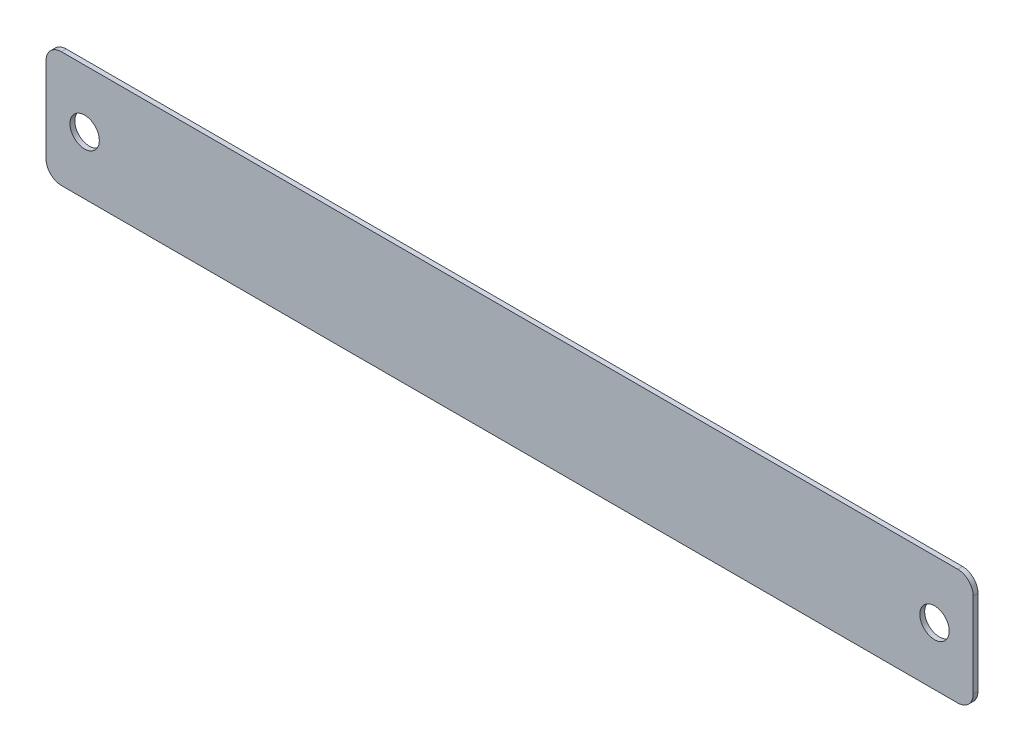
ISO-10303-21;
HEADER;
FILE_DESCRIPTION(('STEP AP214'),'2;1');
FILE_NAME('part.step','',(''),(''),'','','');
FILE_SCHEMA(('AUTOMOTIVE_DESIGN { 1 0 10303 214 1 1 1 1 }'));
ENDSEC;
DATA;
#1=APPLICATION_CONTEXT('core data for automotive mechanical design processes');
#2=APPLICATION_PROTOCOL_DEFINITION('international standard','automotive_design',2000,#1);
#3=PRODUCT_CONTEXT('',#1,'mechanical');
#4=PRODUCT('Part','Part','',(#3));
#5=PRODUCT_RELATED_PRODUCT_CATEGORY('part','',(#4));
#6=PRODUCT_DEFINITION_FORMATION('','',#4);
#7=PRODUCT_DEFINITION_CONTEXT('part definition',#1,'design');
#8=PRODUCT_DEFINITION('design','',#6,#7);
#9=PRODUCT_DEFINITION_SHAPE('','',#8);
#10=(LENGTH_UNIT() NAMED_UNIT(*) SI_UNIT(.MILLI.,.METRE.));
#11=(NAMED_UNIT(*) PLANE_ANGLE_UNIT() SI_UNIT($,.RADIAN.));
#12=(NAMED_UNIT(*) SI_UNIT($,.STERADIAN.) SOLID_ANGLE_UNIT());
#13=UNCERTAINTY_MEASURE_WITH_UNIT(LENGTH_MEASURE(1.E-05),#10,'distance_accuracy_value','');
#14=(GEOMETRIC_REPRESENTATION_CONTEXT(3) GLOBAL_UNCERTAINTY_ASSIGNED_CONTEXT((#13)) GLOBAL_UNIT_ASSIGNED_CONTEXT((#10,
#11,#12)) REPRESENTATION_CONTEXT('',''));
#15=CARTESIAN_POINT('',(0.,0.,0.));
#16=DIRECTION('',(0.,0.,1.));
#17=DIRECTION('',(1.,0.,0.));
#18=AXIS2_PLACEMENT_3D('',#15,#16,#17);
#19=CARTESIAN_POINT('',(0.,0.,0.79375));
#20=DIRECTION('',(0.,0.,-1.));
#21=DIRECTION('',(-1.,0.,0.));
#22=AXIS2_PLACEMENT_3D('',#19,#20,#21);
#23=PLANE('',#22);
#24=CARTESIAN_POINT('',(6.35,9.525,0.79375));
#25=DIRECTION('',(0.,0.,1.));
#26=DIRECTION('',(1.,0.,0.));
#27=AXIS2_PLACEMENT_3D('',#24,#25,#26);
#28=CIRCLE('',#27,2.413);
#29=CARTESIAN_POINT('',(8.763,9.525,0.79375));
#30=VERTEX_POINT('',#29);
#31=EDGE_CURVE('E130',#30,#30,#28,.T.);
#32=ORIENTED_EDGE('',*,*,#31,.F.);
#33=EDGE_LOOP('',(#32));
#34=FACE_BOUND('',#33,.T.);
#35=DIRECTION('',(-1.,0.,0.));
#36=VECTOR('',#35,1.);
#37=CARTESIAN_POINT('',(0.,19.05,0.79375));
#38=LINE('',#37,#36);
#39=CARTESIAN_POINT('',(149.86,19.05,0.79375));
#40=VERTEX_POINT('',#39);
#41=CARTESIAN_POINT('',(2.54,19.05,0.79375));
#42=VERTEX_POINT('',#41);
#43=EDGE_CURVE('E139',#40,#42,#38,.T.);
#44=ORIENTED_EDGE('',*,*,#43,.T.);
#45=CARTESIAN_POINT('',(2.54,16.51,0.79375));
#46=DIRECTION('',(0.,0.,-1.));
#47=DIRECTION('',(-1.,0.,0.));
#48=AXIS2_PLACEMENT_3D('',#45,#46,#47);
#49=CIRCLE('',#48,2.54);
#50=CARTESIAN_POINT('',(0.,16.51,0.79375));
#51=VERTEX_POINT('',#50);
#52=EDGE_CURVE('E157',#42,#51,#49,.F.);
#53=ORIENTED_EDGE('',*,*,#52,.T.);
#54=DIRECTION('',(0.,-1.,0.));
#55=VECTOR('',#54,1.);
#56=CARTESIAN_POINT('',(0.,0.,0.79375));
#57=LINE('',#56,#55);
#58=CARTESIAN_POINT('',(0.,2.54,0.79375));
#59=VERTEX_POINT('',#58);
#60=EDGE_CURVE('E121',#51,#59,#57,.T.);
#61=ORIENTED_EDGE('',*,*,#60,.T.);
#62=CARTESIAN_POINT('',(2.54,2.54,0.79375));
#63=DIRECTION('',(0.,0.,-1.));
#64=DIRECTION('',(-1.,0.,0.));
#65=AXIS2_PLACEMENT_3D('',#62,#63,#64);
#66=CIRCLE('',#65,2.54);
#67=CARTESIAN_POINT('',(2.54,0.,0.79375));
#68=VERTEX_POINT('',#67);
#69=EDGE_CURVE('E154',#59,#68,#66,.F.);
#70=ORIENTED_EDGE('',*,*,#69,.T.);
#71=DIRECTION('',(1.,0.,0.));
#72=VECTOR('',#71,1.);
#73=CARTESIAN_POINT('',(0.,0.,0.79375));
#74=LINE('',#73,#72);
#75=CARTESIAN_POINT('',(149.86,0.,0.79375));
#76=VERTEX_POINT('',#75);
#77=EDGE_CURVE('E168',#68,#76,#74,.T.);
#78=ORIENTED_EDGE('',*,*,#77,.T.);
#79=CARTESIAN_POINT('',(149.86,2.54,0.79375));
#80=DIRECTION('',(0.,0.,-1.));
#81=DIRECTION('',(-1.,0.,0.));
#82=AXIS2_PLACEMENT_3D('',#79,#80,#81);
#83=CIRCLE('',#82,2.54);
#84=CARTESIAN_POINT('',(152.4,2.54,0.79375));
#85=VERTEX_POINT('',#84);
#86=EDGE_CURVE('E57',#76,#85,#83,.F.);
#87=ORIENTED_EDGE('',*,*,#86,.T.);
#88=DIRECTION('',(0.,1.,0.));
#89=VECTOR('',#88,1.);
#90=CARTESIAN_POINT('',(152.4,0.,0.79375));
#91=LINE('',#90,#89);
#92=CARTESIAN_POINT('',(152.4,16.51,0.79375));
#93=VERTEX_POINT('',#92);
#94=EDGE_CURVE('E176',#85,#93,#91,.T.);
#95=ORIENTED_EDGE('',*,*,#94,.T.);
#96=CARTESIAN_POINT('',(149.86,16.51,0.79375));
#97=DIRECTION('',(0.,0.,-1.));
#98=DIRECTION('',(-1.,0.,0.));
#99=AXIS2_PLACEMENT_3D('',#96,#97,#98);
#100=CIRCLE('',#99,2.54);
#101=EDGE_CURVE('E152',#93,#40,#100,.F.);
#102=ORIENTED_EDGE('',*,*,#101,.T.);
#103=EDGE_LOOP('',(#44,#53,#61,#70,#78,#87,#95,#102));
#104=FACE_BOUND('',#103,.T.);
#105=CARTESIAN_POINT('',(146.05,9.525,0.79375));
#106=DIRECTION('',(0.,0.,1.));
#107=DIRECTION('',(1.,0.,0.));
#108=AXIS2_PLACEMENT_3D('',#105,#106,#107);
#109=CIRCLE('',#108,2.41299999999999);
#110=CARTESIAN_POINT('',(148.463,9.525,0.79375));
#111=VERTEX_POINT('',#110);
#112=EDGE_CURVE('E183',#111,#111,#109,.T.);
#113=ORIENTED_EDGE('',*,*,#112,.F.);
#114=EDGE_LOOP('',(#113));
#115=FACE_BOUND('',#114,.T.);
#116=ADVANCED_FACE('F35',(#34,#104,#115),#23,.F.);
#117=CARTESIAN_POINT('',(0.,0.,0.));
#118=DIRECTION('',(0.,0.,-1.));
#119=DIRECTION('',(-1.,0.,0.));
#120=AXIS2_PLACEMENT_3D('',#117,#118,#119);
#121=PLANE('',#120);
#122=CARTESIAN_POINT('',(6.35,9.525,0.));
#123=DIRECTION('',(0.,0.,1.));
#124=DIRECTION('',(1.,0.,0.));
#125=AXIS2_PLACEMENT_3D('',#122,#123,#124);
#126=CIRCLE('',#125,2.413);
#127=CARTESIAN_POINT('',(8.763,9.525,0.));
#128=VERTEX_POINT('',#127);
#129=EDGE_CURVE('E136',#128,#128,#126,.T.);
#130=ORIENTED_EDGE('',*,*,#129,.T.);
#131=EDGE_LOOP('',(#130));
#132=FACE_BOUND('',#131,.T.);
#133=DIRECTION('',(0.,-1.,0.));
#134=VECTOR('',#133,1.);
#135=CARTESIAN_POINT('',(0.,0.,0.));
#136=LINE('',#135,#134);
#137=CARTESIAN_POINT('',(0.,16.51,0.));
#138=VERTEX_POINT('',#137);
#139=CARTESIAN_POINT('',(0.,2.54,0.));
#140=VERTEX_POINT('',#139);
#141=EDGE_CURVE('E118',#138,#140,#136,.T.);
#142=ORIENTED_EDGE('',*,*,#141,.F.);
#143=CARTESIAN_POINT('',(2.54,16.51,0.));
#144=DIRECTION('',(0.,0.,-1.));
#145=DIRECTION('',(-1.,0.,0.));
#146=AXIS2_PLACEMENT_3D('',#143,#144,#145);
#147=CIRCLE('',#146,2.54);
#148=CARTESIAN_POINT('',(2.54,19.05,0.));
#149=VERTEX_POINT('',#148);
#150=EDGE_CURVE('E101',#138,#149,#147,.T.);
#151=ORIENTED_EDGE('',*,*,#150,.T.);
#152=DIRECTION('',(-1.,0.,0.));
#153=VECTOR('',#152,1.);
#154=CARTESIAN_POINT('',(0.,19.05,0.));
#155=LINE('',#154,#153);
#156=CARTESIAN_POINT('',(149.86,19.05,0.));
#157=VERTEX_POINT('',#156);
#158=EDGE_CURVE('E143',#157,#149,#155,.T.);
#159=ORIENTED_EDGE('',*,*,#158,.F.);
#160=CARTESIAN_POINT('',(149.86,16.51,0.));
#161=DIRECTION('',(0.,0.,-1.));
#162=DIRECTION('',(-1.,0.,0.));
#163=AXIS2_PLACEMENT_3D('',#160,#161,#162);
#164=CIRCLE('',#163,2.54);
#165=CARTESIAN_POINT('',(152.4,16.51,0.));
#166=VERTEX_POINT('',#165);
#167=EDGE_CURVE('E122',#157,#166,#164,.T.);
#168=ORIENTED_EDGE('',*,*,#167,.T.);
#169=DIRECTION('',(0.,1.,0.));
#170=VECTOR('',#169,1.);
#171=CARTESIAN_POINT('',(152.4,0.,0.));
#172=LINE('',#171,#170);
#173=CARTESIAN_POINT('',(152.4,2.54,0.));
#174=VERTEX_POINT('',#173);
#175=EDGE_CURVE('E133',#174,#166,#172,.T.);
#176=ORIENTED_EDGE('',*,*,#175,.F.);
#177=CARTESIAN_POINT('',(149.86,2.54,0.));
#178=DIRECTION('',(0.,0.,-1.));
#179=DIRECTION('',(-1.,0.,0.));
#180=AXIS2_PLACEMENT_3D('',#177,#178,#179);
#181=CIRCLE('',#180,2.54);
#182=CARTESIAN_POINT('',(149.86,0.,0.));
#183=VERTEX_POINT('',#182);
#184=EDGE_CURVE('E112',#174,#183,#181,.T.);
#185=ORIENTED_EDGE('',*,*,#184,.T.);
#186=DIRECTION('',(1.,0.,0.));
#187=VECTOR('',#186,1.);
#188=CARTESIAN_POINT('',(0.,0.,0.));
#189=LINE('',#188,#187);
#190=CARTESIAN_POINT('',(2.54,0.,0.));
#191=VERTEX_POINT('',#190);
#192=EDGE_CURVE('E129',#191,#183,#189,.T.);
#193=ORIENTED_EDGE('',*,*,#192,.F.);
#194=CARTESIAN_POINT('',(2.54,2.54,0.));
#195=DIRECTION('',(0.,0.,-1.));
#196=DIRECTION('',(-1.,0.,0.));
#197=AXIS2_PLACEMENT_3D('',#194,#195,#196);
#198=CIRCLE('',#197,2.54);
#199=EDGE_CURVE('E128',#191,#140,#198,.T.);
#200=ORIENTED_EDGE('',*,*,#199,.T.);
#201=EDGE_LOOP('',(#142,#151,#159,#168,#176,#185,#193,#200));
#202=FACE_BOUND('',#201,.T.);
#203=CARTESIAN_POINT('',(146.05,9.525,0.));
#204=DIRECTION('',(0.,0.,1.));
#205=DIRECTION('',(1.,0.,0.));
#206=AXIS2_PLACEMENT_3D('',#203,#204,#205);
#207=CIRCLE('',#206,2.41299999999999);
#208=CARTESIAN_POINT('',(148.463,9.525,0.));
#209=VERTEX_POINT('',#208);
#210=EDGE_CURVE('E185',#209,#209,#207,.T.);
#211=ORIENTED_EDGE('',*,*,#210,.T.);
#212=EDGE_LOOP('',(#211));
#213=FACE_BOUND('',#212,.T.);
#214=ADVANCED_FACE('F125',(#132,#202,#213),#121,.T.);
#215=CARTESIAN_POINT('',(0.,0.,0.79375));
#216=DIRECTION('',(1.,0.,0.));
#217=DIRECTION('',(0.,0.,-1.));
#218=AXIS2_PLACEMENT_3D('',#215,#216,#217);
#219=PLANE('',#218);
#220=ORIENTED_EDGE('',*,*,#60,.F.);
#221=DIRECTION('',(0.,0.,-1.));
#222=VECTOR('',#221,1.);
#223=CARTESIAN_POINT('',(0.,16.51,0.79375));
#224=LINE('',#223,#222);
#225=EDGE_CURVE('E105',#51,#138,#224,.T.);
#226=ORIENTED_EDGE('',*,*,#225,.T.);
#227=ORIENTED_EDGE('',*,*,#141,.T.);
#228=DIRECTION('',(0.,0.,-1.));
#229=VECTOR('',#228,1.);
#230=CARTESIAN_POINT('',(0.,2.54,0.79375));
#231=LINE('',#230,#229);
#232=EDGE_CURVE('E123',#140,#59,#231,.F.);
#233=ORIENTED_EDGE('',*,*,#232,.T.);
#234=EDGE_LOOP('',(#220,#226,#227,#233));
#235=FACE_BOUND('',#234,.T.);
#236=ADVANCED_FACE('F117',(#235),#219,.F.);
#237=CARTESIAN_POINT('',(0.,0.,0.79375));
#238=DIRECTION('',(0.,1.,0.));
#239=DIRECTION('',(0.,0.,1.));
#240=AXIS2_PLACEMENT_3D('',#237,#238,#239);
#241=PLANE('',#240);
#242=ORIENTED_EDGE('',*,*,#192,.T.);
#243=DIRECTION('',(0.,0.,-1.));
#244=VECTOR('',#243,1.);
#245=CARTESIAN_POINT('',(149.86,0.,0.79375));
#246=LINE('',#245,#244);
#247=EDGE_CURVE('E11',#183,#76,#246,.F.);
#248=ORIENTED_EDGE('',*,*,#247,.T.);
#249=ORIENTED_EDGE('',*,*,#77,.F.);
#250=DIRECTION('',(0.,0.,-1.));
#251=VECTOR('',#250,1.);
#252=CARTESIAN_POINT('',(2.54,0.,0.79375));
#253=LINE('',#252,#251);
#254=EDGE_CURVE('E43',#68,#191,#253,.T.);
#255=ORIENTED_EDGE('',*,*,#254,.T.);
#256=EDGE_LOOP('',(#242,#248,#249,#255));
#257=FACE_BOUND('',#256,.T.);
#258=ADVANCED_FACE('F166',(#257),#241,.F.);
#259=CARTESIAN_POINT('',(152.4,0.,0.79375));
#260=DIRECTION('',(-1.,0.,0.));
#261=DIRECTION('',(0.,0.,1.));
#262=AXIS2_PLACEMENT_3D('',#259,#260,#261);
#263=PLANE('',#262);
#264=ORIENTED_EDGE('',*,*,#94,.F.);
#265=DIRECTION('',(0.,0.,-1.));
#266=VECTOR('',#265,1.);
#267=CARTESIAN_POINT('',(152.4,2.54,0.79375));
#268=LINE('',#267,#266);
#269=EDGE_CURVE('E160',#85,#174,#268,.T.);
#270=ORIENTED_EDGE('',*,*,#269,.T.);
#271=ORIENTED_EDGE('',*,*,#175,.T.);
#272=DIRECTION('',(0.,0.,-1.));
#273=VECTOR('',#272,1.);
#274=CARTESIAN_POINT('',(152.4,16.51,0.79375));
#275=LINE('',#274,#273);
#276=EDGE_CURVE('E50',#166,#93,#275,.F.);
#277=ORIENTED_EDGE('',*,*,#276,.T.);
#278=EDGE_LOOP('',(#264,#270,#271,#277));
#279=FACE_BOUND('',#278,.T.);
#280=ADVANCED_FACE('F175',(#279),#263,.F.);
#281=CARTESIAN_POINT('',(0.,19.05,0.79375));
#282=DIRECTION('',(0.,-1.,0.));
#283=DIRECTION('',(0.,0.,-1.));
#284=AXIS2_PLACEMENT_3D('',#281,#282,#283);
#285=PLANE('',#284);
#286=ORIENTED_EDGE('',*,*,#158,.T.);
#287=DIRECTION('',(0.,0.,-1.));
#288=VECTOR('',#287,1.);
#289=CARTESIAN_POINT('',(2.54,19.05,0.79375));
#290=LINE('',#289,#288);
#291=EDGE_CURVE('E106',#149,#42,#290,.F.);
#292=ORIENTED_EDGE('',*,*,#291,.T.);
#293=ORIENTED_EDGE('',*,*,#43,.F.);
#294=DIRECTION('',(0.,0.,-1.));
#295=VECTOR('',#294,1.);
#296=CARTESIAN_POINT('',(149.86,19.05,0.79375));
#297=LINE('',#296,#295);
#298=EDGE_CURVE('E111',#40,#157,#297,.T.);
#299=ORIENTED_EDGE('',*,*,#298,.T.);
#300=EDGE_LOOP('',(#286,#292,#293,#299));
#301=FACE_BOUND('',#300,.T.);
#302=ADVANCED_FACE('F207',(#301),#285,.F.);
#303=CARTESIAN_POINT('',(6.35,9.525,0.79375));
#304=DIRECTION('',(0.,0.,-1.));
#305=DIRECTION('',(-1.,0.,0.));
#306=AXIS2_PLACEMENT_3D('',#303,#304,#305);
#307=CYLINDRICAL_SURFACE('',#306,2.413);
#308=ORIENTED_EDGE('',*,*,#31,.T.);
#309=EDGE_LOOP('',(#308));
#310=FACE_BOUND('',#309,.T.);
#311=ORIENTED_EDGE('',*,*,#129,.F.);
#312=EDGE_LOOP('',(#311));
#313=FACE_BOUND('',#312,.T.);
#314=ADVANCED_FACE('F204',(#310,#313),#307,.F.);
#315=CARTESIAN_POINT('',(146.05,9.525,0.79375));
#316=DIRECTION('',(0.,0.,-1.));
#317=DIRECTION('',(-1.,0.,0.));
#318=AXIS2_PLACEMENT_3D('',#315,#316,#317);
#319=CYLINDRICAL_SURFACE('',#318,2.41299999999999);
#320=ORIENTED_EDGE('',*,*,#112,.T.);
#321=EDGE_LOOP('',(#320));
#322=FACE_BOUND('',#321,.T.);
#323=ORIENTED_EDGE('',*,*,#210,.F.);
#324=EDGE_LOOP('',(#323));
#325=FACE_BOUND('',#324,.T.);
#326=ADVANCED_FACE('F191',(#322,#325),#319,.F.);
#327=CARTESIAN_POINT('',(2.54,16.51,0.79375));
#328=DIRECTION('',(0.,0.,-1.));
#329=DIRECTION('',(-1.,0.,0.));
#330=AXIS2_PLACEMENT_3D('',#327,#328,#329);
#331=CYLINDRICAL_SURFACE('',#330,2.54);
#332=ORIENTED_EDGE('',*,*,#52,.F.);
#333=ORIENTED_EDGE('',*,*,#291,.F.);
#334=ORIENTED_EDGE('',*,*,#150,.F.);
#335=ORIENTED_EDGE('',*,*,#225,.F.);
#336=EDGE_LOOP('',(#332,#333,#334,#335));
#337=FACE_BOUND('',#336,.T.);
#338=ADVANCED_FACE('F104',(#337),#331,.T.);
#339=CARTESIAN_POINT('',(149.86,2.54,0.79375));
#340=DIRECTION('',(0.,0.,-1.));
#341=DIRECTION('',(-1.,0.,0.));
#342=AXIS2_PLACEMENT_3D('',#339,#340,#341);
#343=CYLINDRICAL_SURFACE('',#342,2.54);
#344=ORIENTED_EDGE('',*,*,#86,.F.);
#345=ORIENTED_EDGE('',*,*,#247,.F.);
#346=ORIENTED_EDGE('',*,*,#184,.F.);
#347=ORIENTED_EDGE('',*,*,#269,.F.);
#348=EDGE_LOOP('',(#344,#345,#346,#347));
#349=FACE_BOUND('',#348,.T.);
#350=ADVANCED_FACE('F174',(#349),#343,.T.);
#351=CARTESIAN_POINT('',(2.54,2.54,0.79375));
#352=DIRECTION('',(0.,0.,-1.));
#353=DIRECTION('',(-1.,0.,0.));
#354=AXIS2_PLACEMENT_3D('',#351,#352,#353);
#355=CYLINDRICAL_SURFACE('',#354,2.54);
#356=ORIENTED_EDGE('',*,*,#69,.F.);
#357=ORIENTED_EDGE('',*,*,#232,.F.);
#358=ORIENTED_EDGE('',*,*,#199,.F.);
#359=ORIENTED_EDGE('',*,*,#254,.F.);
#360=EDGE_LOOP('',(#356,#357,#358,#359));
#361=FACE_BOUND('',#360,.T.);
#362=ADVANCED_FACE('F220',(#361),#355,.T.);
#363=CARTESIAN_POINT('',(149.86,16.51,0.79375));
#364=DIRECTION('',(0.,0.,-1.));
#365=DIRECTION('',(-1.,0.,0.));
#366=AXIS2_PLACEMENT_3D('',#363,#364,#365);
#367=CYLINDRICAL_SURFACE('',#366,2.54);
#368=ORIENTED_EDGE('',*,*,#101,.F.);
#369=ORIENTED_EDGE('',*,*,#276,.F.);
#370=ORIENTED_EDGE('',*,*,#167,.F.);
#371=ORIENTED_EDGE('',*,*,#298,.F.);
#372=EDGE_LOOP('',(#368,#369,#370,#371));
#373=FACE_BOUND('',#372,.T.);
#374=ADVANCED_FACE('F37',(#373),#367,.T.);
#375=CLOSED_SHELL('',(#116,#214,#236,#258,#280,#302,#314,#326,#338,#350,#362,#374));
#376=MANIFOLD_SOLID_BREP('B2',#375);
#377=ADVANCED_BREP_SHAPE_REPRESENTATION('',(#18,#376),#14);
#378=SHAPE_DEFINITION_REPRESENTATION(#9,#377);
ENDSEC;
END-ISO-10303-21;
